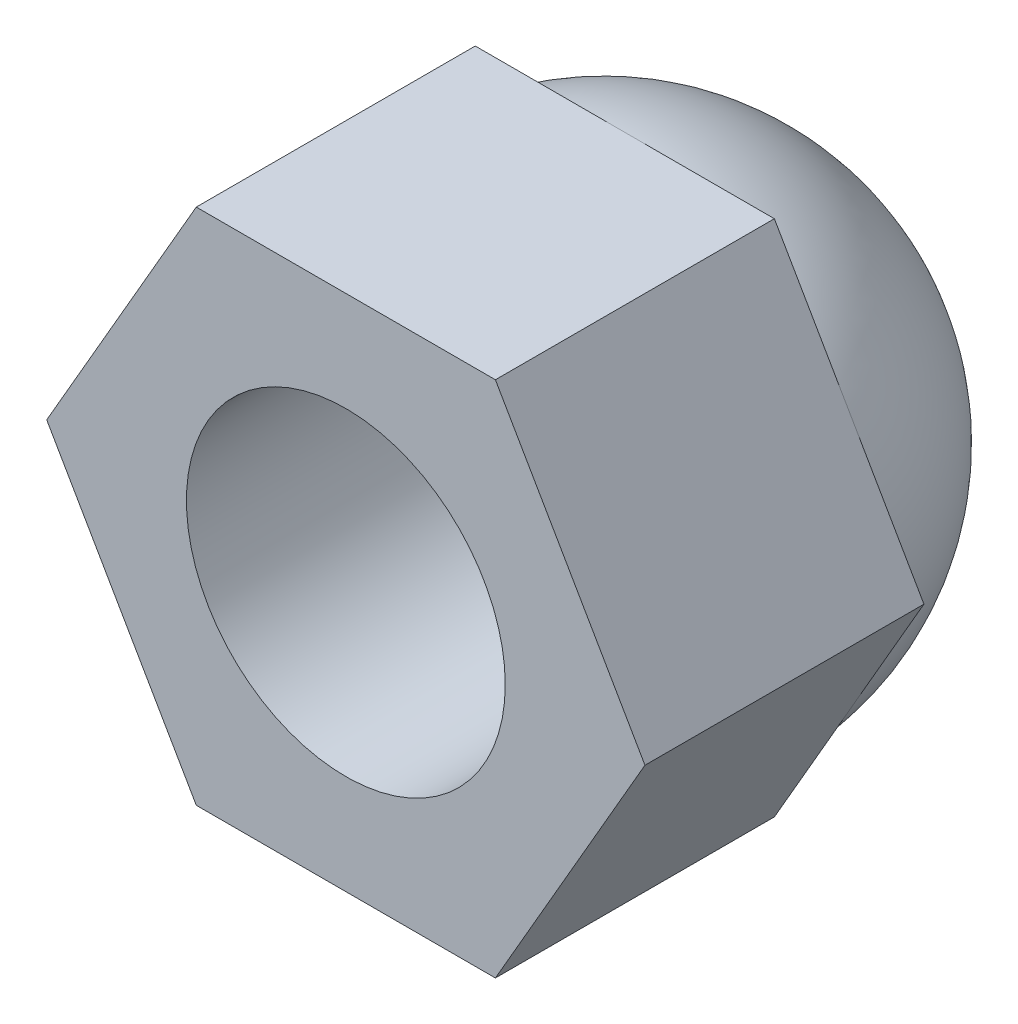
ISO-10303-21;
HEADER;
FILE_DESCRIPTION(('STEP AP214'),'2;1');
FILE_NAME('part.step','',(''),(''),'','','');
FILE_SCHEMA(('AUTOMOTIVE_DESIGN { 1 0 10303 214 1 1 1 1 }'));
ENDSEC;
DATA;
#1=APPLICATION_CONTEXT('core data for automotive mechanical design processes');
#2=APPLICATION_PROTOCOL_DEFINITION('international standard','automotive_design',2000,#1);
#3=PRODUCT_CONTEXT('',#1,'mechanical');
#4=PRODUCT('Part','Part','',(#3));
#5=PRODUCT_RELATED_PRODUCT_CATEGORY('part','',(#4));
#6=PRODUCT_DEFINITION_FORMATION('','',#4);
#7=PRODUCT_DEFINITION_CONTEXT('part definition',#1,'design');
#8=PRODUCT_DEFINITION('design','',#6,#7);
#9=PRODUCT_DEFINITION_SHAPE('','',#8);
#10=(LENGTH_UNIT() NAMED_UNIT(*) SI_UNIT(.MILLI.,.METRE.));
#11=(NAMED_UNIT(*) PLANE_ANGLE_UNIT() SI_UNIT($,.RADIAN.));
#12=(NAMED_UNIT(*) SI_UNIT($,.STERADIAN.) SOLID_ANGLE_UNIT());
#13=UNCERTAINTY_MEASURE_WITH_UNIT(LENGTH_MEASURE(1.E-05),#10,'distance_accuracy_value','');
#14=(GEOMETRIC_REPRESENTATION_CONTEXT(3) GLOBAL_UNCERTAINTY_ASSIGNED_CONTEXT((#13)) GLOBAL_UNIT_ASSIGNED_CONTEXT((#10,
#11,#12)) REPRESENTATION_CONTEXT('',''));
#15=CARTESIAN_POINT('',(0.,0.,0.));
#16=DIRECTION('',(0.,0.,1.));
#17=DIRECTION('',(1.,0.,0.));
#18=AXIS2_PLACEMENT_3D('',#15,#16,#17);
#19=CARTESIAN_POINT('',(0.,0.,0.));
#20=DIRECTION('',(0.,0.,1.));
#21=DIRECTION('',(1.,0.,0.));
#22=AXIS2_PLACEMENT_3D('',#19,#20,#21);
#23=PLANE('',#22);
#24=CARTESIAN_POINT('',(0.,0.,0.));
#25=DIRECTION('',(0.,0.,1.));
#26=DIRECTION('',(1.,0.,0.));
#27=AXIS2_PLACEMENT_3D('',#24,#25,#26);
#28=CIRCLE('',#27,6.49999999999993);
#29=CARTESIAN_POINT('',(5.62916512459881,-3.24999999999993,0.));
#30=VERTEX_POINT('',#29);
#31=CARTESIAN_POINT('',(0.,-6.49999999999997,0.));
#32=VERTEX_POINT('',#31);
#33=EDGE_CURVE('E11',#30,#32,#28,.F.);
#34=ORIENTED_EDGE('',*,*,#33,.F.);
#35=DIRECTION('',(0.499999999999995,0.866025403784442,0.));
#36=VECTOR('',#35,1.);
#37=CARTESIAN_POINT('',(3.75277674973263,-6.49999999999993,0.));
#38=LINE('',#37,#36);
#39=CARTESIAN_POINT('',(3.75277674973263,-6.49999999999993,0.));
#40=VERTEX_POINT('',#39);
#41=EDGE_CURVE('E113',#40,#30,#38,.T.);
#42=ORIENTED_EDGE('',*,*,#41,.F.);
#43=DIRECTION('',(1.,0.,0.));
#44=VECTOR('',#43,1.);
#45=CARTESIAN_POINT('',(-3.75277674973249,-6.50000000000001,0.));
#46=LINE('',#45,#44);
#47=EDGE_CURVE('E128',#32,#40,#46,.T.);
#48=ORIENTED_EDGE('',*,*,#47,.F.);
#49=EDGE_LOOP('',(#34,#42,#48));
#50=FACE_BOUND('',#49,.T.);
#51=ADVANCED_FACE('F39',(#50),#23,.F.);
#52=CARTESIAN_POINT('',(-5.6291651245988,-3.25000000000003,0.));
#53=VERTEX_POINT('',#52);
#54=EDGE_CURVE('E48',#32,#53,#28,.F.);
#55=ORIENTED_EDGE('',*,*,#54,.F.);
#56=CARTESIAN_POINT('',(-3.75277674973249,-6.50000000000001,0.));
#57=VERTEX_POINT('',#56);
#58=EDGE_CURVE('E153',#57,#32,#46,.T.);
#59=ORIENTED_EDGE('',*,*,#58,.F.);
#60=DIRECTION('',(0.500000000000007,-0.866025403784435,0.));
#61=VECTOR('',#60,1.);
#62=CARTESIAN_POINT('',(-7.50555349946511,0.,0.));
#63=LINE('',#62,#61);
#64=EDGE_CURVE('E159',#53,#57,#63,.T.);
#65=ORIENTED_EDGE('',*,*,#64,.F.);
#66=EDGE_LOOP('',(#55,#59,#65));
#67=FACE_BOUND('',#66,.T.);
#68=ADVANCED_FACE('F209',(#67),#23,.F.);
#69=CARTESIAN_POINT('',(-5.62916512459885,3.24999999999995,0.));
#70=VERTEX_POINT('',#69);
#71=EDGE_CURVE('E136',#53,#70,#28,.F.);
#72=ORIENTED_EDGE('',*,*,#71,.F.);
#73=CARTESIAN_POINT('',(-7.50555349946511,0.,0.));
#74=VERTEX_POINT('',#73);
#75=EDGE_CURVE('E156',#74,#53,#63,.T.);
#76=ORIENTED_EDGE('',*,*,#75,.F.);
#77=DIRECTION('',(-0.499999999999995,-0.866025403784441,0.));
#78=VECTOR('',#77,1.);
#79=CARTESIAN_POINT('',(-3.75277674973258,6.49999999999996,0.));
#80=LINE('',#79,#78);
#81=EDGE_CURVE('E163',#70,#74,#80,.T.);
#82=ORIENTED_EDGE('',*,*,#81,.F.);
#83=EDGE_LOOP('',(#72,#76,#82));
#84=FACE_BOUND('',#83,.T.);
#85=ADVANCED_FACE('F214',(#84),#23,.F.);
#86=CARTESIAN_POINT('',(0.,6.49999999999997,0.));
#87=VERTEX_POINT('',#86);
#88=EDGE_CURVE('E134',#70,#87,#28,.F.);
#89=ORIENTED_EDGE('',*,*,#88,.F.);
#90=CARTESIAN_POINT('',(-3.75277674973258,6.49999999999996,0.));
#91=VERTEX_POINT('',#90);
#92=EDGE_CURVE('E160',#91,#70,#80,.T.);
#93=ORIENTED_EDGE('',*,*,#92,.F.);
#94=DIRECTION('',(-1.,0.,0.));
#95=VECTOR('',#94,1.);
#96=CARTESIAN_POINT('',(3.75277674973254,6.49999999999999,0.));
#97=LINE('',#96,#95);
#98=EDGE_CURVE('E167',#87,#91,#97,.T.);
#99=ORIENTED_EDGE('',*,*,#98,.F.);
#100=EDGE_LOOP('',(#89,#93,#99));
#101=FACE_BOUND('',#100,.T.);
#102=ADVANCED_FACE('F222',(#101),#23,.F.);
#103=CARTESIAN_POINT('',(0.,0.,0.));
#104=DIRECTION('',(0.,0.,1.));
#105=DIRECTION('',(1.,0.,0.));
#106=AXIS2_PLACEMENT_3D('',#103,#104,#105);
#107=CIRCLE('',#106,6.49999999999993);
#108=CARTESIAN_POINT('',(5.62916512459882,3.24999999999999,0.));
#109=VERTEX_POINT('',#108);
#110=EDGE_CURVE('E61',#109,#87,#107,.T.);
#111=ORIENTED_EDGE('',*,*,#110,.T.);
#112=CARTESIAN_POINT('',(3.75277674973254,6.49999999999999,0.));
#113=VERTEX_POINT('',#112);
#114=EDGE_CURVE('E164',#113,#87,#97,.T.);
#115=ORIENTED_EDGE('',*,*,#114,.F.);
#116=DIRECTION('',(-0.500000000000001,0.866025403784438,0.));
#117=VECTOR('',#116,1.);
#118=CARTESIAN_POINT('',(7.50555349946511,0.,0.));
#119=LINE('',#118,#117);
#120=EDGE_CURVE('E122',#109,#113,#119,.T.);
#121=ORIENTED_EDGE('',*,*,#120,.F.);
#122=EDGE_LOOP('',(#111,#115,#121));
#123=FACE_BOUND('',#122,.T.);
#124=ADVANCED_FACE('F226',(#123),#23,.F.);
#125=CARTESIAN_POINT('',(3.75277674973263,-6.49999999999993,7.));
#126=DIRECTION('',(-0.866025403784442,0.499999999999995,0.));
#127=DIRECTION('',(-0.499999999999995,-0.866025403784442,0.));
#128=AXIS2_PLACEMENT_3D('',#125,#126,#127);
#129=PLANE('',#128);
#130=ORIENTED_EDGE('',*,*,#41,.T.);
#131=CARTESIAN_POINT('',(7.50555349946511,0.,0.));
#132=VERTEX_POINT('',#131);
#133=EDGE_CURVE('E115',#30,#132,#38,.T.);
#134=ORIENTED_EDGE('',*,*,#133,.T.);
#135=DIRECTION('',(0.,0.,-1.));
#136=VECTOR('',#135,1.);
#137=CARTESIAN_POINT('',(7.50555349946511,0.,7.));
#138=LINE('',#137,#136);
#139=CARTESIAN_POINT('',(7.50555349946511,0.,7.));
#140=VERTEX_POINT('',#139);
#141=EDGE_CURVE('E135',#140,#132,#138,.T.);
#142=ORIENTED_EDGE('',*,*,#141,.F.);
#143=DIRECTION('',(0.499999999999995,0.866025403784442,0.));
#144=VECTOR('',#143,1.);
#145=CARTESIAN_POINT('',(3.75277674973263,-6.49999999999993,7.));
#146=LINE('',#145,#144);
#147=CARTESIAN_POINT('',(3.75277674973263,-6.49999999999993,7.));
#148=VERTEX_POINT('',#147);
#149=EDGE_CURVE('E155',#148,#140,#146,.T.);
#150=ORIENTED_EDGE('',*,*,#149,.F.);
#151=DIRECTION('',(0.,0.,-1.));
#152=VECTOR('',#151,1.);
#153=CARTESIAN_POINT('',(3.75277674973263,-6.49999999999993,7.));
#154=LINE('',#153,#152);
#155=EDGE_CURVE('E118',#148,#40,#154,.T.);
#156=ORIENTED_EDGE('',*,*,#155,.T.);
#157=EDGE_LOOP('',(#130,#134,#142,#150,#156));
#158=FACE_BOUND('',#157,.T.);
#159=ADVANCED_FACE('F41',(#158),#129,.F.);
#160=CARTESIAN_POINT('',(7.50555349946511,0.,7.));
#161=DIRECTION('',(-0.866025403784438,-0.500000000000001,0.));
#162=DIRECTION('',(0.500000000000001,-0.866025403784438,0.));
#163=AXIS2_PLACEMENT_3D('',#160,#161,#162);
#164=PLANE('',#163);
#165=EDGE_CURVE('E126',#132,#109,#119,.T.);
#166=ORIENTED_EDGE('',*,*,#165,.T.);
#167=ORIENTED_EDGE('',*,*,#120,.T.);
#168=DIRECTION('',(0.,0.,-1.));
#169=VECTOR('',#168,1.);
#170=CARTESIAN_POINT('',(3.75277674973254,6.49999999999999,7.));
#171=LINE('',#170,#169);
#172=CARTESIAN_POINT('',(3.75277674973254,6.49999999999999,7.));
#173=VERTEX_POINT('',#172);
#174=EDGE_CURVE('E137',#173,#113,#171,.T.);
#175=ORIENTED_EDGE('',*,*,#174,.F.);
#176=DIRECTION('',(-0.500000000000001,0.866025403784438,0.));
#177=VECTOR('',#176,1.);
#178=CARTESIAN_POINT('',(7.50555349946511,0.,7.));
#179=LINE('',#178,#177);
#180=EDGE_CURVE('E176',#140,#173,#179,.T.);
#181=ORIENTED_EDGE('',*,*,#180,.F.);
#182=ORIENTED_EDGE('',*,*,#141,.T.);
#183=EDGE_LOOP('',(#166,#167,#175,#181,#182));
#184=FACE_BOUND('',#183,.T.);
#185=ADVANCED_FACE('F227',(#184),#164,.F.);
#186=CARTESIAN_POINT('',(3.75277674973254,6.49999999999999,7.));
#187=DIRECTION('',(0.,-1.,0.));
#188=DIRECTION('',(1.,0.,0.));
#189=AXIS2_PLACEMENT_3D('',#186,#187,#188);
#190=PLANE('',#189);
#191=ORIENTED_EDGE('',*,*,#114,.T.);
#192=ORIENTED_EDGE('',*,*,#98,.T.);
#193=DIRECTION('',(0.,0.,-1.));
#194=VECTOR('',#193,1.);
#195=CARTESIAN_POINT('',(-3.75277674973258,6.49999999999996,7.));
#196=LINE('',#195,#194);
#197=CARTESIAN_POINT('',(-3.75277674973258,6.49999999999996,7.));
#198=VERTEX_POINT('',#197);
#199=EDGE_CURVE('E140',#198,#91,#196,.T.);
#200=ORIENTED_EDGE('',*,*,#199,.F.);
#201=DIRECTION('',(-1.,0.,0.));
#202=VECTOR('',#201,1.);
#203=CARTESIAN_POINT('',(3.75277674973254,6.49999999999999,7.));
#204=LINE('',#203,#202);
#205=EDGE_CURVE('E174',#173,#198,#204,.T.);
#206=ORIENTED_EDGE('',*,*,#205,.F.);
#207=ORIENTED_EDGE('',*,*,#174,.T.);
#208=EDGE_LOOP('',(#191,#192,#200,#206,#207));
#209=FACE_BOUND('',#208,.T.);
#210=ADVANCED_FACE('F224',(#209),#190,.F.);
#211=CARTESIAN_POINT('',(-3.75277674973258,6.49999999999996,7.));
#212=DIRECTION('',(0.866025403784441,-0.499999999999995,0.));
#213=DIRECTION('',(0.499999999999995,0.866025403784442,0.));
#214=AXIS2_PLACEMENT_3D('',#211,#212,#213);
#215=PLANE('',#214);
#216=ORIENTED_EDGE('',*,*,#92,.T.);
#217=ORIENTED_EDGE('',*,*,#81,.T.);
#218=DIRECTION('',(0.,0.,-1.));
#219=VECTOR('',#218,1.);
#220=CARTESIAN_POINT('',(-7.50555349946511,0.,7.));
#221=LINE('',#220,#219);
#222=CARTESIAN_POINT('',(-7.50555349946511,0.,7.));
#223=VERTEX_POINT('',#222);
#224=EDGE_CURVE('E145',#223,#74,#221,.T.);
#225=ORIENTED_EDGE('',*,*,#224,.F.);
#226=DIRECTION('',(-0.499999999999995,-0.866025403784441,0.));
#227=VECTOR('',#226,1.);
#228=CARTESIAN_POINT('',(-3.75277674973258,6.49999999999996,7.));
#229=LINE('',#228,#227);
#230=EDGE_CURVE('E172',#198,#223,#229,.T.);
#231=ORIENTED_EDGE('',*,*,#230,.F.);
#232=ORIENTED_EDGE('',*,*,#199,.T.);
#233=EDGE_LOOP('',(#216,#217,#225,#231,#232));
#234=FACE_BOUND('',#233,.T.);
#235=ADVANCED_FACE('F218',(#234),#215,.F.);
#236=CARTESIAN_POINT('',(-7.50555349946511,0.,7.));
#237=DIRECTION('',(0.866025403784435,0.500000000000007,0.));
#238=DIRECTION('',(-0.500000000000007,0.866025403784435,0.));
#239=AXIS2_PLACEMENT_3D('',#236,#237,#238);
#240=PLANE('',#239);
#241=ORIENTED_EDGE('',*,*,#75,.T.);
#242=ORIENTED_EDGE('',*,*,#64,.T.);
#243=DIRECTION('',(0.,0.,-1.));
#244=VECTOR('',#243,1.);
#245=CARTESIAN_POINT('',(-3.75277674973249,-6.50000000000001,7.));
#246=LINE('',#245,#244);
#247=CARTESIAN_POINT('',(-3.75277674973249,-6.50000000000001,7.));
#248=VERTEX_POINT('',#247);
#249=EDGE_CURVE('E148',#248,#57,#246,.T.);
#250=ORIENTED_EDGE('',*,*,#249,.F.);
#251=DIRECTION('',(0.500000000000007,-0.866025403784435,0.));
#252=VECTOR('',#251,1.);
#253=CARTESIAN_POINT('',(-7.50555349946511,0.,7.));
#254=LINE('',#253,#252);
#255=EDGE_CURVE('E170',#223,#248,#254,.T.);
#256=ORIENTED_EDGE('',*,*,#255,.F.);
#257=ORIENTED_EDGE('',*,*,#224,.T.);
#258=EDGE_LOOP('',(#241,#242,#250,#256,#257));
#259=FACE_BOUND('',#258,.T.);
#260=ADVANCED_FACE('F298',(#259),#240,.F.);
#261=CARTESIAN_POINT('',(-3.75277674973249,-6.50000000000001,7.));
#262=DIRECTION('',(0.,1.,0.));
#263=DIRECTION('',(-1.,0.,0.));
#264=AXIS2_PLACEMENT_3D('',#261,#262,#263);
#265=PLANE('',#264);
#266=ORIENTED_EDGE('',*,*,#58,.T.);
#267=ORIENTED_EDGE('',*,*,#47,.T.);
#268=ORIENTED_EDGE('',*,*,#155,.F.);
#269=DIRECTION('',(1.,0.,0.));
#270=VECTOR('',#269,1.);
#271=CARTESIAN_POINT('',(-3.75277674973249,-6.50000000000001,7.));
#272=LINE('',#271,#270);
#273=EDGE_CURVE('E152',#248,#148,#272,.T.);
#274=ORIENTED_EDGE('',*,*,#273,.F.);
#275=ORIENTED_EDGE('',*,*,#249,.T.);
#276=EDGE_LOOP('',(#266,#267,#268,#274,#275));
#277=FACE_BOUND('',#276,.T.);
#278=ADVANCED_FACE('F199',(#277),#265,.F.);
#279=CARTESIAN_POINT('',(0.,0.,7.));
#280=DIRECTION('',(0.,0.,1.));
#281=DIRECTION('',(1.,0.,0.));
#282=AXIS2_PLACEMENT_3D('',#279,#280,#281);
#283=PLANE('',#282);
#284=CARTESIAN_POINT('',(0.,0.,7.));
#285=DIRECTION('',(0.,0.,1.));
#286=DIRECTION('',(1.,0.,0.));
#287=AXIS2_PLACEMENT_3D('',#284,#285,#286);
#288=CIRCLE('',#287,4.);
#289=CARTESIAN_POINT('',(4.,0.,7.));
#290=VERTEX_POINT('',#289);
#291=EDGE_CURVE('E182',#290,#290,#288,.T.);
#292=ORIENTED_EDGE('',*,*,#291,.F.);
#293=EDGE_LOOP('',(#292));
#294=FACE_BOUND('',#293,.T.);
#295=ORIENTED_EDGE('',*,*,#149,.T.);
#296=ORIENTED_EDGE('',*,*,#180,.T.);
#297=ORIENTED_EDGE('',*,*,#205,.T.);
#298=ORIENTED_EDGE('',*,*,#230,.T.);
#299=ORIENTED_EDGE('',*,*,#255,.T.);
#300=ORIENTED_EDGE('',*,*,#273,.T.);
#301=EDGE_LOOP('',(#295,#296,#297,#298,#299,#300));
#302=FACE_BOUND('',#301,.T.);
#303=ADVANCED_FACE('F196',(#294,#302),#283,.T.);
#304=EDGE_CURVE('E43',#109,#30,#28,.F.);
#305=ORIENTED_EDGE('',*,*,#304,.F.);
#306=ORIENTED_EDGE('',*,*,#165,.F.);
#307=ORIENTED_EDGE('',*,*,#133,.F.);
#308=EDGE_LOOP('',(#305,#306,#307));
#309=FACE_BOUND('',#308,.T.);
#310=ADVANCED_FACE('F124',(#309),#23,.F.);
#311=CARTESIAN_POINT('',(0.,0.,0.520833333333261));
#312=DIRECTION('',(0.,0.,1.));
#313=DIRECTION('',(0.,1.,0.));
#314=AXIS2_PLACEMENT_3D('',#311,#312,#313);
#315=SPHERICAL_SURFACE('',#314,6.52083333333326);
#316=ORIENTED_EDGE('',*,*,#110,.F.);
#317=ORIENTED_EDGE('',*,*,#304,.T.);
#318=ORIENTED_EDGE('',*,*,#33,.T.);
#319=ORIENTED_EDGE('',*,*,#54,.T.);
#320=ORIENTED_EDGE('',*,*,#71,.T.);
#321=ORIENTED_EDGE('',*,*,#88,.T.);
#322=EDGE_LOOP('',(#316,#317,#318,#319,#320,#321));
#323=FACE_BOUND('',#322,.T.);
#324=ADVANCED_FACE('F132',(#323),#315,.T.);
#325=CARTESIAN_POINT('',(0.,0.,0.));
#326=DIRECTION('',(0.,0.,1.));
#327=DIRECTION('',(1.,0.,0.));
#328=AXIS2_PLACEMENT_3D('',#325,#326,#327);
#329=CYLINDRICAL_SURFACE('',#328,4.);
#330=CARTESIAN_POINT('',(0.,0.,0.));
#331=DIRECTION('',(0.,0.,1.));
#332=DIRECTION('',(1.,0.,0.));
#333=AXIS2_PLACEMENT_3D('',#330,#331,#332);
#334=CIRCLE('',#333,4.);
#335=CARTESIAN_POINT('',(4.,0.,0.));
#336=VERTEX_POINT('',#335);
#337=EDGE_CURVE('E181',#336,#336,#334,.T.);
#338=ORIENTED_EDGE('',*,*,#337,.F.);
#339=EDGE_LOOP('',(#338));
#340=FACE_BOUND('',#339,.T.);
#341=ORIENTED_EDGE('',*,*,#291,.T.);
#342=EDGE_LOOP('',(#341));
#343=FACE_BOUND('',#342,.T.);
#344=ADVANCED_FACE('F190',(#340,#343),#329,.F.);
#345=CARTESIAN_POINT('',(0.,0.,0.));
#346=DIRECTION('',(0.,0.,1.));
#347=DIRECTION('',(1.,0.,0.));
#348=AXIS2_PLACEMENT_3D('',#345,#346,#347);
#349=PLANE('',#348);
#350=ORIENTED_EDGE('',*,*,#337,.T.);
#351=EDGE_LOOP('',(#350));
#352=FACE_BOUND('',#351,.T.);
#353=ADVANCED_FACE('F188',(#352),#349,.T.);
#354=CLOSED_SHELL('',(#51,#68,#85,#102,#124,#159,#185,#210,#235,#260,#278,#303,#310,#324,#344,#353));
#355=MANIFOLD_SOLID_BREP('B2',#354);
#356=ADVANCED_BREP_SHAPE_REPRESENTATION('',(#18,#355),#14);
#357=SHAPE_DEFINITION_REPRESENTATION(#9,#356);
ENDSEC;
END-ISO-10303-21;
